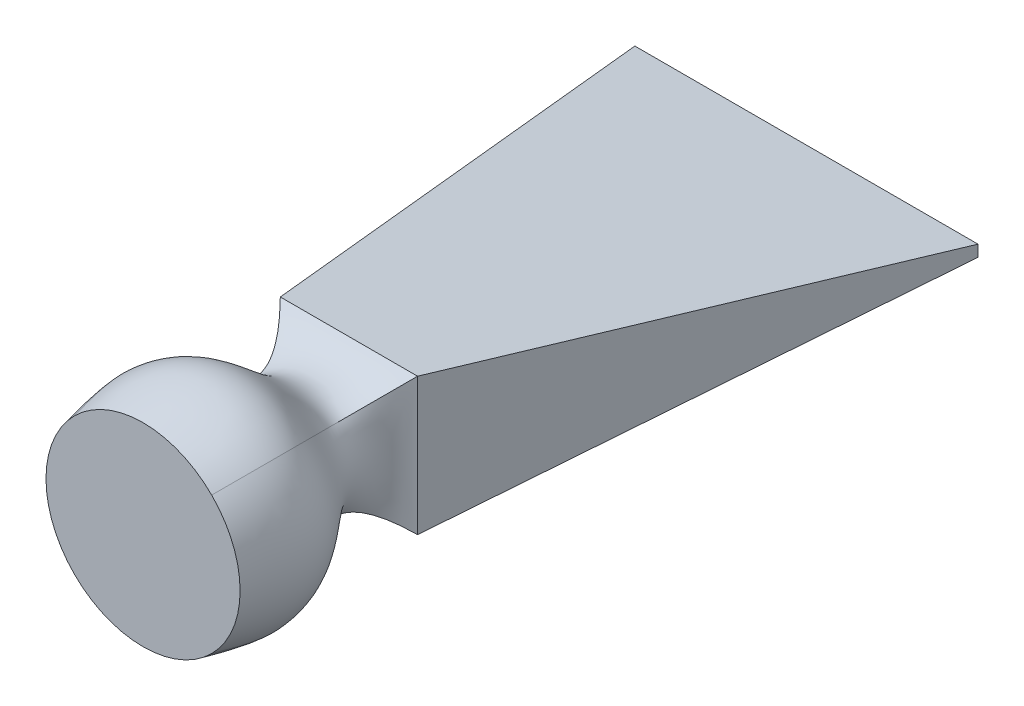
ISO-10303-21;
HEADER;
FILE_DESCRIPTION(('STEP AP214'),'2;1');
FILE_NAME('part.step','',(''),(''),'','','');
FILE_SCHEMA(('AUTOMOTIVE_DESIGN { 1 0 10303 214 1 1 1 1 }'));
ENDSEC;
DATA;
#1=APPLICATION_CONTEXT('core data for automotive mechanical design processes');
#2=APPLICATION_PROTOCOL_DEFINITION('international standard','automotive_design',2000,#1);
#3=PRODUCT_CONTEXT('',#1,'mechanical');
#4=PRODUCT('Part','Part','',(#3));
#5=PRODUCT_RELATED_PRODUCT_CATEGORY('part','',(#4));
#6=PRODUCT_DEFINITION_FORMATION('','',#4);
#7=PRODUCT_DEFINITION_CONTEXT('part definition',#1,'design');
#8=PRODUCT_DEFINITION('design','',#6,#7);
#9=PRODUCT_DEFINITION_SHAPE('','',#8);
#10=(LENGTH_UNIT() NAMED_UNIT(*) SI_UNIT(.MILLI.,.METRE.));
#11=(NAMED_UNIT(*) PLANE_ANGLE_UNIT() SI_UNIT($,.RADIAN.));
#12=(NAMED_UNIT(*) SI_UNIT($,.STERADIAN.) SOLID_ANGLE_UNIT());
#13=UNCERTAINTY_MEASURE_WITH_UNIT(LENGTH_MEASURE(1.E-05),#10,'distance_accuracy_value','');
#14=(GEOMETRIC_REPRESENTATION_CONTEXT(3) GLOBAL_UNCERTAINTY_ASSIGNED_CONTEXT((#13)) GLOBAL_UNIT_ASSIGNED_CONTEXT((#10,
#11,#12)) REPRESENTATION_CONTEXT('',''));
#15=CARTESIAN_POINT('',(0.,0.,0.));
#16=DIRECTION('',(0.,0.,1.));
#17=DIRECTION('',(1.,0.,0.));
#18=AXIS2_PLACEMENT_3D('',#15,#16,#17);
#19=CARTESIAN_POINT('',(0.,0.,90.));
#20=DIRECTION('',(0.,0.,1.));
#21=DIRECTION('',(1.,0.,0.));
#22=AXIS2_PLACEMENT_3D('',#19,#20,#21);
#23=PLANE('',#22);
#24=CARTESIAN_POINT('',(0.,0.,90.));
#25=DIRECTION('',(0.,0.,1.));
#26=DIRECTION('',(1.,0.,0.));
#27=AXIS2_PLACEMENT_3D('',#24,#25,#26);
#28=CIRCLE('',#27,42.4264068711929);
#29=CARTESIAN_POINT('',(30.,-30.,90.));
#30=VERTEX_POINT('',#29);
#31=CARTESIAN_POINT('',(30.,30.,90.));
#32=VERTEX_POINT('',#31);
#33=EDGE_CURVE('E12',#30,#32,#28,.T.);
#34=ORIENTED_EDGE('',*,*,#33,.T.);
#35=CARTESIAN_POINT('',(-30.,30.,90.));
#36=VERTEX_POINT('',#35);
#37=EDGE_CURVE('E84',#32,#36,#28,.T.);
#38=ORIENTED_EDGE('',*,*,#37,.T.);
#39=CARTESIAN_POINT('',(-30.,-30.,90.));
#40=VERTEX_POINT('',#39);
#41=EDGE_CURVE('E354',#36,#40,#28,.T.);
#42=ORIENTED_EDGE('',*,*,#41,.T.);
#43=EDGE_CURVE('E276',#40,#30,#28,.T.);
#44=ORIENTED_EDGE('',*,*,#43,.T.);
#45=EDGE_LOOP('',(#34,#38,#42,#44));
#46=FACE_BOUND('',#45,.T.);
#47=ADVANCED_FACE('F75',(#46),#23,.T.);
#48=CARTESIAN_POINT('',(30.,30.,0.));
#49=CARTESIAN_POINT('',(21.7851130197758,21.7851130197758,8.33333333333334));
#50=CARTESIAN_POINT('',(11.4480792780272,11.4480792780272,26.6842583231321));
#51=CARTESIAN_POINT('',(36.5877389212421,36.5877389212421,50.9567471285879));
#52=CARTESIAN_POINT('',(32.3581604097574,32.3581604097574,75.7725733783253));
#53=CARTESIAN_POINT('',(30.,30.,90.));
#54=CARTESIAN_POINT('',(10.,30.,0.));
#55=CARTESIAN_POINT('',(7.26170433992527,21.7851130197758,8.33333333333334));
#56=CARTESIAN_POINT('',(6.36969580298355,23.7303286113224,26.6842583231321));
#57=CARTESIAN_POINT('',(15.9903753094837,54.8377649087592,50.9567471285879));
#58=CARTESIAN_POINT('',(14.2286031722261,48.9156107074504,75.7725733783253));
#59=CARTESIAN_POINT('',(13.442549702307,46.557450297693,90.));
#60=CARTESIAN_POINT('',(-10.,30.,0.));
#61=CARTESIAN_POINT('',(-7.26170433992526,21.7851130197758,8.33333333333334));
#62=CARTESIAN_POINT('',(-6.36969580298354,23.7303286113224,26.6842583231321));
#63=CARTESIAN_POINT('',(-15.9903753094837,54.8377649087592,50.9567471285879));
#64=CARTESIAN_POINT('',(-14.2286031722261,48.9156107074504,75.7725733783253));
#65=CARTESIAN_POINT('',(-13.442549702307,46.557450297693,90.));
#66=CARTESIAN_POINT('',(-30.,30.,0.));
#67=CARTESIAN_POINT('',(-21.7851130197758,21.7851130197758,8.33333333333334));
#68=CARTESIAN_POINT('',(-11.4480792780272,11.4480792780272,26.6842583231321));
#69=CARTESIAN_POINT('',(-36.5877389212421,36.5877389212421,50.9567471285879));
#70=CARTESIAN_POINT('',(-32.3581604097574,32.3581604097574,75.7725733783253));
#71=CARTESIAN_POINT('',(-30.,30.,90.));
#72=B_SPLINE_SURFACE_WITH_KNOTS('',3,3,((#48,#49,#50,#51,#52,#53),(#54,#55,#56,#57,#58,#59),
(#60,#61,#62,#63,#64,#65),(#66,#67,#68,#69,#70,#71)),.UNSPECIFIED.,.F.,.F.,.F.,(4,4),(4,1,1,4),
(0.,1.),(0.,0.284226887704337,0.593739185555325,1.),.UNSPECIFIED.);
#73=DIRECTION('',(-1.,0.,0.));
#74=VECTOR('',#73,1.);
#75=CARTESIAN_POINT('',(-30.,30.,0.));
#76=LINE('',#75,#74);
#77=CARTESIAN_POINT('',(30.,30.,0.));
#78=VERTEX_POINT('',#77);
#79=CARTESIAN_POINT('',(-30.,30.,0.));
#80=VERTEX_POINT('',#79);
#81=EDGE_CURVE('E395',#78,#80,#76,.T.);
#82=CARTESIAN_POINT('',(-30.,30.,0.));
#83=CARTESIAN_POINT('',(-21.7851130197758,21.7851130197758,8.33333333333334));
#84=CARTESIAN_POINT('',(-11.4480792780272,11.4480792780272,26.6842583231321));
#85=CARTESIAN_POINT('',(-36.5877389212421,36.5877389212421,50.9567471285879));
#86=CARTESIAN_POINT('',(-32.3581604097574,32.3581604097574,75.7725733783253));
#87=CARTESIAN_POINT('',(-30.,30.,90.));
#88=B_SPLINE_CURVE_WITH_KNOTS('',3,(#82,#83,#84,#85,#86,#87),.UNSPECIFIED.,.F.,.F.,(4,1,1,4),
(0.,0.284226887704337,0.593739185555325,1.),.UNSPECIFIED.);
#89=EDGE_CURVE('E267',#80,#36,#88,.T.);
#90=CARTESIAN_POINT('',(30.,30.,0.));
#91=CARTESIAN_POINT('',(21.7851130197758,21.7851130197758,8.33333333333334));
#92=CARTESIAN_POINT('',(11.4480792780272,11.4480792780272,26.6842583231321));
#93=CARTESIAN_POINT('',(36.5877389212421,36.5877389212421,50.9567471285879));
#94=CARTESIAN_POINT('',(32.3581604097574,32.3581604097574,75.7725733783253));
#95=CARTESIAN_POINT('',(30.,30.,90.));
#96=B_SPLINE_CURVE_WITH_KNOTS('',3,(#90,#91,#92,#93,#94,#95),.UNSPECIFIED.,.F.,.F.,(4,1,1,4),
(0.,0.284226887704337,0.593739185555325,1.),.UNSPECIFIED.);
#97=EDGE_CURVE('E281',#32,#78,#96,.F.);
#98=ORIENTED_EDGE('',*,*,#81,.T.);
#99=ORIENTED_EDGE('',*,*,#89,.T.);
#100=ORIENTED_EDGE('',*,*,#37,.F.);
#101=ORIENTED_EDGE('',*,*,#97,.T.);
#102=EDGE_LOOP('',(#98,#99,#100,#101));
#103=FACE_BOUND('',#102,.T.);
#104=ADVANCED_FACE('F190',(#103),#72,.T.);
#105=CARTESIAN_POINT('',(-30.,30.,0.));
#106=CARTESIAN_POINT('',(-21.7851130197758,21.7851130197758,8.33333333333334));
#107=CARTESIAN_POINT('',(-11.4480792780272,11.4480792780272,26.6842583231321));
#108=CARTESIAN_POINT('',(-36.5877389212421,36.5877389212421,50.9567471285879));
#109=CARTESIAN_POINT('',(-32.3581604097574,32.3581604097574,75.7725733783253));
#110=CARTESIAN_POINT('',(-30.,30.,90.));
#111=CARTESIAN_POINT('',(-30.,10.,0.));
#112=CARTESIAN_POINT('',(-21.7851130197758,7.26170433992527,8.33333333333334));
#113=CARTESIAN_POINT('',(-23.7303286113224,6.36969580298355,26.6842583231321));
#114=CARTESIAN_POINT('',(-54.8377649087592,15.9903753094837,50.9567471285879));
#115=CARTESIAN_POINT('',(-48.9156107074504,14.2286031722261,75.7725733783253));
#116=CARTESIAN_POINT('',(-46.557450297693,13.442549702307,90.));
#117=CARTESIAN_POINT('',(-30.,-10.,0.));
#118=CARTESIAN_POINT('',(-21.7851130197758,-7.26170433992526,8.33333333333334));
#119=CARTESIAN_POINT('',(-23.7303286113224,-6.36969580298354,26.6842583231321));
#120=CARTESIAN_POINT('',(-54.8377649087592,-15.9903753094837,50.9567471285879));
#121=CARTESIAN_POINT('',(-48.9156107074504,-14.2286031722261,75.7725733783253));
#122=CARTESIAN_POINT('',(-46.557450297693,-13.442549702307,90.));
#123=CARTESIAN_POINT('',(-30.,-30.,0.));
#124=CARTESIAN_POINT('',(-21.7851130197758,-21.7851130197758,8.33333333333334));
#125=CARTESIAN_POINT('',(-11.4480792780272,-11.4480792780272,26.6842583231321));
#126=CARTESIAN_POINT('',(-36.5877389212421,-36.5877389212421,50.9567471285879));
#127=CARTESIAN_POINT('',(-32.3581604097574,-32.3581604097574,75.7725733783253));
#128=CARTESIAN_POINT('',(-30.,-30.,90.));
#129=B_SPLINE_SURFACE_WITH_KNOTS('',3,3,((#105,#106,#107,#108,#109,#110),(#111,#112,#113,#114,
#115,#116),(#117,#118,#119,#120,#121,#122),(#123,#124,#125,#126,#127,#128)),.UNSPECIFIED.,.F.,
.F.,.F.,(4,4),(4,1,1,4),(0.,1.),(0.,0.284226887704337,0.593739185555325,1.),.UNSPECIFIED.);
#130=DIRECTION('',(0.,-1.,0.));
#131=VECTOR('',#130,1.);
#132=CARTESIAN_POINT('',(-30.,-30.,0.));
#133=LINE('',#132,#131);
#134=CARTESIAN_POINT('',(-30.,-30.,0.));
#135=VERTEX_POINT('',#134);
#136=EDGE_CURVE('E388',#80,#135,#133,.T.);
#137=CARTESIAN_POINT('',(-30.,-30.,0.));
#138=CARTESIAN_POINT('',(-21.7851130197758,-21.7851130197758,8.33333333333334));
#139=CARTESIAN_POINT('',(-11.4480792780272,-11.4480792780272,26.6842583231321));
#140=CARTESIAN_POINT('',(-36.5877389212421,-36.5877389212421,50.9567471285879));
#141=CARTESIAN_POINT('',(-32.3581604097574,-32.3581604097574,75.7725733783253));
#142=CARTESIAN_POINT('',(-30.,-30.,90.));
#143=B_SPLINE_CURVE_WITH_KNOTS('',3,(#137,#138,#139,#140,#141,#142),.UNSPECIFIED.,.F.,.F.,(4,1,
1,4),(0.,0.284226887704337,0.593739185555325,1.),.UNSPECIFIED.);
#144=EDGE_CURVE('E258',#135,#40,#143,.T.);
#145=ORIENTED_EDGE('',*,*,#136,.T.);
#146=ORIENTED_EDGE('',*,*,#144,.T.);
#147=ORIENTED_EDGE('',*,*,#41,.F.);
#148=ORIENTED_EDGE('',*,*,#89,.F.);
#149=EDGE_LOOP('',(#145,#146,#147,#148));
#150=FACE_BOUND('',#149,.T.);
#151=ADVANCED_FACE('F331',(#150),#129,.T.);
#152=CARTESIAN_POINT('',(30.,-30.,0.));
#153=CARTESIAN_POINT('',(21.7851130197758,-21.7851130197758,8.33333333333334));
#154=CARTESIAN_POINT('',(11.4480792780272,-11.4480792780272,26.6842583231321));
#155=CARTESIAN_POINT('',(36.5877389212421,-36.5877389212421,50.9567471285879));
#156=CARTESIAN_POINT('',(32.3581604097574,-32.3581604097574,75.7725733783253));
#157=CARTESIAN_POINT('',(30.,-30.,90.));
#158=CARTESIAN_POINT('',(30.,-10.,0.));
#159=CARTESIAN_POINT('',(21.7851130197758,-7.26170433992526,8.33333333333334));
#160=CARTESIAN_POINT('',(23.7303286113224,-6.36969580298355,26.6842583231321));
#161=CARTESIAN_POINT('',(54.8377649087593,-15.9903753094837,50.9567471285879));
#162=CARTESIAN_POINT('',(48.9156107074504,-14.2286031722261,75.7725733783253));
#163=CARTESIAN_POINT('',(46.557450297693,-13.442549702307,90.));
#164=CARTESIAN_POINT('',(30.,10.,0.));
#165=CARTESIAN_POINT('',(21.7851130197758,7.26170433992526,8.33333333333334));
#166=CARTESIAN_POINT('',(23.7303286113224,6.36969580298354,26.6842583231321));
#167=CARTESIAN_POINT('',(54.8377649087593,15.9903753094837,50.9567471285879));
#168=CARTESIAN_POINT('',(48.9156107074504,14.2286031722261,75.7725733783253));
#169=CARTESIAN_POINT('',(46.557450297693,13.442549702307,90.));
#170=CARTESIAN_POINT('',(30.,30.,0.));
#171=CARTESIAN_POINT('',(21.7851130197758,21.7851130197758,8.33333333333334));
#172=CARTESIAN_POINT('',(11.4480792780272,11.4480792780272,26.6842583231321));
#173=CARTESIAN_POINT('',(36.5877389212421,36.5877389212421,50.9567471285879));
#174=CARTESIAN_POINT('',(32.3581604097574,32.3581604097574,75.7725733783253));
#175=CARTESIAN_POINT('',(30.,30.,90.));
#176=B_SPLINE_SURFACE_WITH_KNOTS('',3,3,((#152,#153,#154,#155,#156,#157),(#158,#159,#160,#161,
#162,#163),(#164,#165,#166,#167,#168,#169),(#170,#171,#172,#173,#174,#175)),.UNSPECIFIED.,.F.,
.F.,.F.,(4,4),(4,1,1,4),(0.,1.),(0.,0.284226887704337,0.593739185555325,1.),.UNSPECIFIED.);
#177=DIRECTION('',(0.,1.,0.));
#178=VECTOR('',#177,1.);
#179=CARTESIAN_POINT('',(30.,-30.,0.));
#180=LINE('',#179,#178);
#181=CARTESIAN_POINT('',(30.,-30.,0.));
#182=VERTEX_POINT('',#181);
#183=EDGE_CURVE('E163',#182,#78,#180,.T.);
#184=CARTESIAN_POINT('',(30.,-30.,0.));
#185=CARTESIAN_POINT('',(21.7851130197758,-21.7851130197758,8.33333333333334));
#186=CARTESIAN_POINT('',(11.4480792780272,-11.4480792780272,26.6842583231321));
#187=CARTESIAN_POINT('',(36.5877389212421,-36.5877389212421,50.9567471285879));
#188=CARTESIAN_POINT('',(32.3581604097574,-32.3581604097574,75.7725733783253));
#189=CARTESIAN_POINT('',(30.,-30.,90.));
#190=B_SPLINE_CURVE_WITH_KNOTS('',3,(#184,#185,#186,#187,#188,#189),.UNSPECIFIED.,.F.,.F.,(4,1,
1,4),(0.,0.284226887704337,0.593739185555325,1.),.UNSPECIFIED.);
#191=EDGE_CURVE('E266',#182,#30,#190,.T.);
#192=ORIENTED_EDGE('',*,*,#183,.T.);
#193=ORIENTED_EDGE('',*,*,#97,.F.);
#194=ORIENTED_EDGE('',*,*,#33,.F.);
#195=ORIENTED_EDGE('',*,*,#191,.F.);
#196=EDGE_LOOP('',(#192,#193,#194,#195));
#197=FACE_BOUND('',#196,.T.);
#198=ADVANCED_FACE('F321',(#197),#176,.T.);
#199=CARTESIAN_POINT('',(-30.,-30.,0.));
#200=CARTESIAN_POINT('',(-21.7851130197758,-21.7851130197758,8.33333333333334));
#201=CARTESIAN_POINT('',(-11.4480792780272,-11.4480792780272,26.6842583231321));
#202=CARTESIAN_POINT('',(-36.5877389212421,-36.5877389212421,50.9567471285879));
#203=CARTESIAN_POINT('',(-32.3581604097574,-32.3581604097574,75.7725733783253));
#204=CARTESIAN_POINT('',(-30.,-30.,90.));
#205=CARTESIAN_POINT('',(-10.,-30.,0.));
#206=CARTESIAN_POINT('',(-7.26170433992526,-21.7851130197758,8.33333333333334));
#207=CARTESIAN_POINT('',(-6.36969580298355,-23.7303286113224,26.6842583231321));
#208=CARTESIAN_POINT('',(-15.9903753094837,-54.8377649087593,50.9567471285879));
#209=CARTESIAN_POINT('',(-14.2286031722261,-48.9156107074504,75.7725733783253));
#210=CARTESIAN_POINT('',(-13.442549702307,-46.557450297693,90.));
#211=CARTESIAN_POINT('',(10.,-30.,0.));
#212=CARTESIAN_POINT('',(7.26170433992527,-21.7851130197758,8.33333333333334));
#213=CARTESIAN_POINT('',(6.36969580298354,-23.7303286113224,26.6842583231321));
#214=CARTESIAN_POINT('',(15.9903753094837,-54.8377649087593,50.9567471285879));
#215=CARTESIAN_POINT('',(14.2286031722261,-48.9156107074504,75.7725733783253));
#216=CARTESIAN_POINT('',(13.442549702307,-46.557450297693,90.));
#217=CARTESIAN_POINT('',(30.,-30.,0.));
#218=CARTESIAN_POINT('',(21.7851130197758,-21.7851130197758,8.33333333333334));
#219=CARTESIAN_POINT('',(11.4480792780272,-11.4480792780272,26.6842583231321));
#220=CARTESIAN_POINT('',(36.5877389212421,-36.5877389212421,50.9567471285879));
#221=CARTESIAN_POINT('',(32.3581604097574,-32.3581604097574,75.7725733783253));
#222=CARTESIAN_POINT('',(30.,-30.,90.));
#223=B_SPLINE_SURFACE_WITH_KNOTS('',3,3,((#199,#200,#201,#202,#203,#204),(#205,#206,#207,#208,
#209,#210),(#211,#212,#213,#214,#215,#216),(#217,#218,#219,#220,#221,#222)),.UNSPECIFIED.,.F.,
.F.,.F.,(4,4),(4,1,1,4),(0.,1.),(0.,0.284226887704337,0.593739185555325,1.),.UNSPECIFIED.);
#224=DIRECTION('',(1.,0.,0.));
#225=VECTOR('',#224,1.);
#226=CARTESIAN_POINT('',(-30.,-30.,0.));
#227=LINE('',#226,#225);
#228=EDGE_CURVE('E160',#135,#182,#227,.T.);
#229=ORIENTED_EDGE('',*,*,#228,.T.);
#230=ORIENTED_EDGE('',*,*,#191,.T.);
#231=ORIENTED_EDGE('',*,*,#43,.F.);
#232=ORIENTED_EDGE('',*,*,#144,.F.);
#233=EDGE_LOOP('',(#229,#230,#231,#232));
#234=FACE_BOUND('',#233,.T.);
#235=ADVANCED_FACE('F231',(#234),#223,.T.);
#236=CARTESIAN_POINT('',(0.,0.,-200.));
#237=DIRECTION('',(0.,0.,-1.));
#238=DIRECTION('',(-1.,0.,0.));
#239=AXIS2_PLACEMENT_3D('',#236,#237,#238);
#240=PLANE('',#239);
#241=DIRECTION('',(0.,-1.,0.));
#242=VECTOR('',#241,1.);
#243=CARTESIAN_POINT('',(-75.,-2.5,-200.));
#244=LINE('',#243,#242);
#245=CARTESIAN_POINT('',(-75.,2.5,-200.));
#246=VERTEX_POINT('',#245);
#247=CARTESIAN_POINT('',(-75.,-2.5,-200.));
#248=VERTEX_POINT('',#247);
#249=EDGE_CURVE('E134',#246,#248,#244,.T.);
#250=ORIENTED_EDGE('',*,*,#249,.F.);
#251=DIRECTION('',(-1.,0.,0.));
#252=VECTOR('',#251,1.);
#253=CARTESIAN_POINT('',(-75.,2.5,-200.));
#254=LINE('',#253,#252);
#255=CARTESIAN_POINT('',(75.,2.50000000000001,-200.));
#256=VERTEX_POINT('',#255);
#257=EDGE_CURVE('E154',#256,#246,#254,.T.);
#258=ORIENTED_EDGE('',*,*,#257,.F.);
#259=DIRECTION('',(0.,1.,0.));
#260=VECTOR('',#259,1.);
#261=CARTESIAN_POINT('',(75.,-2.5,-200.));
#262=LINE('',#261,#260);
#263=CARTESIAN_POINT('',(75.,-2.5,-200.));
#264=VERTEX_POINT('',#263);
#265=EDGE_CURVE('E136',#264,#256,#262,.T.);
#266=ORIENTED_EDGE('',*,*,#265,.F.);
#267=DIRECTION('',(1.,0.,0.));
#268=VECTOR('',#267,1.);
#269=CARTESIAN_POINT('',(-75.,-2.5,-200.));
#270=LINE('',#269,#268);
#271=EDGE_CURVE('E129',#248,#264,#270,.T.);
#272=ORIENTED_EDGE('',*,*,#271,.F.);
#273=EDGE_LOOP('',(#250,#258,#266,#272));
#274=FACE_BOUND('',#273,.T.);
#275=ADVANCED_FACE('F132',(#274),#240,.T.);
#276=CARTESIAN_POINT('',(28.5544318857823,0.,6.42474717430101));
#277=DIRECTION('',(0.975609756097561,0.,0.219512195121951));
#278=DIRECTION('',(0.219512195121951,0.,-0.975609756097561));
#279=AXIS2_PLACEMENT_3D('',#276,#277,#278);
#280=PLANE('',#279);
#281=DIRECTION('',(0.217563370783763,0.132955393256744,-0.966948314594504));
#282=VECTOR('',#281,1.);
#283=CARTESIAN_POINT('',(30.,-30.,0.));
#284=LINE('',#283,#282);
#285=EDGE_CURVE('E141',#182,#264,#284,.T.);
#286=ORIENTED_EDGE('',*,*,#285,.T.);
#287=ORIENTED_EDGE('',*,*,#265,.T.);
#288=DIRECTION('',(0.217563370783763,-0.132955393256744,-0.966948314594504));
#289=VECTOR('',#288,1.);
#290=CARTESIAN_POINT('',(30.,30.,0.));
#291=LINE('',#290,#289);
#292=EDGE_CURVE('E161',#78,#256,#291,.T.);
#293=ORIENTED_EDGE('',*,*,#292,.F.);
#294=ORIENTED_EDGE('',*,*,#183,.F.);
#295=EDGE_LOOP('',(#286,#287,#293,#294));
#296=FACE_BOUND('',#295,.T.);
#297=ADVANCED_FACE('F220',(#296),#280,.T.);
#298=CARTESIAN_POINT('',(0.,29.4433369115166,-4.04845882533354));
#299=DIRECTION('',(0.,0.990678839845296,-0.136218340478728));
#300=DIRECTION('',(0.,0.136218340478728,0.990678839845296));
#301=AXIS2_PLACEMENT_3D('',#298,#299,#300);
#302=PLANE('',#301);
#303=ORIENTED_EDGE('',*,*,#292,.T.);
#304=ORIENTED_EDGE('',*,*,#257,.T.);
#305=DIRECTION('',(-0.217563370783763,-0.132955393256744,-0.966948314594504));
#306=VECTOR('',#305,1.);
#307=CARTESIAN_POINT('',(-30.,30.,0.));
#308=LINE('',#307,#306);
#309=EDGE_CURVE('E153',#80,#246,#308,.T.);
#310=ORIENTED_EDGE('',*,*,#309,.F.);
#311=ORIENTED_EDGE('',*,*,#81,.F.);
#312=EDGE_LOOP('',(#303,#304,#310,#311));
#313=FACE_BOUND('',#312,.T.);
#314=ADVANCED_FACE('F184',(#313),#302,.T.);
#315=CARTESIAN_POINT('',(0.,-29.4433369115166,-4.04845882533354));
#316=DIRECTION('',(0.,-0.990678839845296,-0.136218340478728));
#317=DIRECTION('',(0.,0.136218340478728,-0.990678839845296));
#318=AXIS2_PLACEMENT_3D('',#315,#316,#317);
#319=PLANE('',#318);
#320=DIRECTION('',(-0.217563370783763,0.132955393256744,-0.966948314594504));
#321=VECTOR('',#320,1.);
#322=CARTESIAN_POINT('',(-30.,-30.,0.));
#323=LINE('',#322,#321);
#324=EDGE_CURVE('E150',#135,#248,#323,.T.);
#325=ORIENTED_EDGE('',*,*,#324,.T.);
#326=ORIENTED_EDGE('',*,*,#271,.T.);
#327=ORIENTED_EDGE('',*,*,#285,.F.);
#328=ORIENTED_EDGE('',*,*,#228,.F.);
#329=EDGE_LOOP('',(#325,#326,#327,#328));
#330=FACE_BOUND('',#329,.T.);
#331=ADVANCED_FACE('F158',(#330),#319,.T.);
#332=CARTESIAN_POINT('',(-28.5544318857823,0.,6.42474717430101));
#333=DIRECTION('',(-0.975609756097561,0.,0.219512195121951));
#334=DIRECTION('',(0.219512195121951,0.,0.975609756097561));
#335=AXIS2_PLACEMENT_3D('',#332,#333,#334);
#336=PLANE('',#335);
#337=ORIENTED_EDGE('',*,*,#309,.T.);
#338=ORIENTED_EDGE('',*,*,#249,.T.);
#339=ORIENTED_EDGE('',*,*,#324,.F.);
#340=ORIENTED_EDGE('',*,*,#136,.F.);
#341=EDGE_LOOP('',(#337,#338,#339,#340));
#342=FACE_BOUND('',#341,.T.);
#343=ADVANCED_FACE('F149',(#342),#336,.T.);
#344=CLOSED_SHELL('',(#47,#104,#151,#198,#235,#275,#297,#314,#331,#343));
#345=MANIFOLD_SOLID_BREP('B2',#344);
#346=ADVANCED_BREP_SHAPE_REPRESENTATION('',(#18,#345),#14);
#347=SHAPE_DEFINITION_REPRESENTATION(#9,#346);
ENDSEC;
END-ISO-10303-21;
